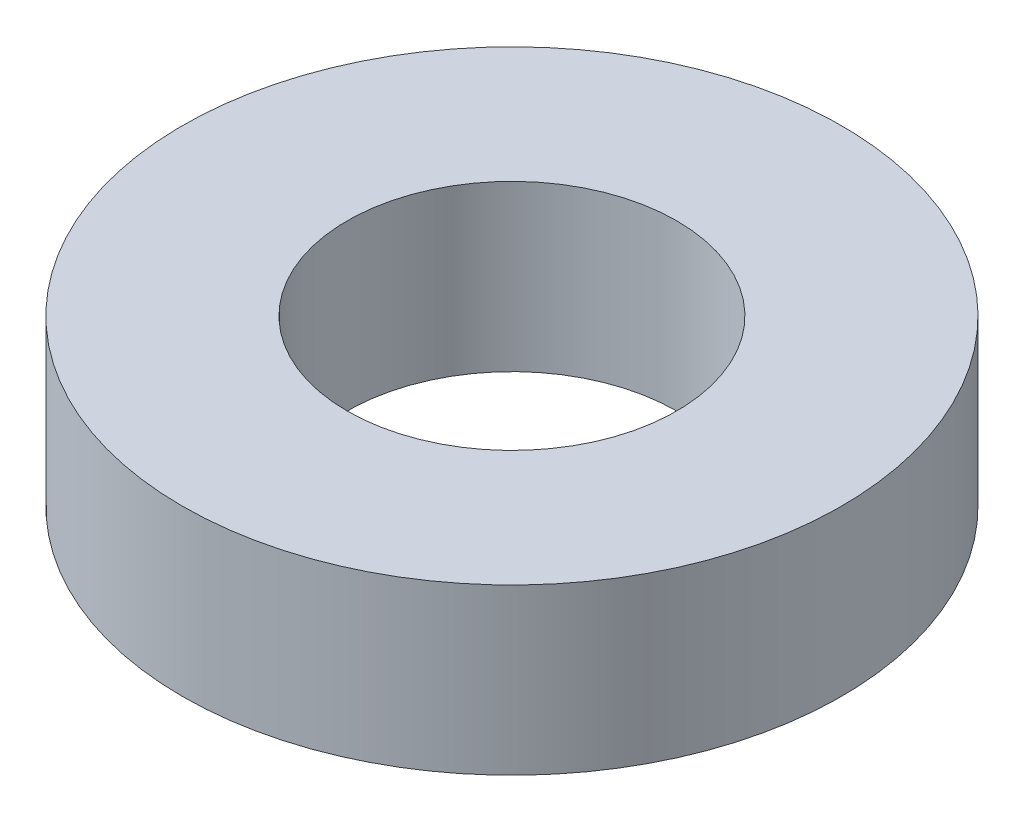
ISO-10303-21;
HEADER;
FILE_DESCRIPTION(('STEP AP214'),'2;1');
FILE_NAME('part.step','',(''),(''),'','','');
FILE_SCHEMA(('AUTOMOTIVE_DESIGN { 1 0 10303 214 1 1 1 1 }'));
ENDSEC;
DATA;
#1=APPLICATION_CONTEXT('core data for automotive mechanical design processes');
#2=APPLICATION_PROTOCOL_DEFINITION('international standard','automotive_design',2000,#1);
#3=PRODUCT_CONTEXT('',#1,'mechanical');
#4=PRODUCT('Part','Part','',(#3));
#5=PRODUCT_RELATED_PRODUCT_CATEGORY('part','',(#4));
#6=PRODUCT_DEFINITION_FORMATION('','',#4);
#7=PRODUCT_DEFINITION_CONTEXT('part definition',#1,'design');
#8=PRODUCT_DEFINITION('design','',#6,#7);
#9=PRODUCT_DEFINITION_SHAPE('','',#8);
#10=(LENGTH_UNIT() NAMED_UNIT(*) SI_UNIT(.MILLI.,.METRE.));
#11=(NAMED_UNIT(*) PLANE_ANGLE_UNIT() SI_UNIT($,.RADIAN.));
#12=(NAMED_UNIT(*) SI_UNIT($,.STERADIAN.) SOLID_ANGLE_UNIT());
#13=UNCERTAINTY_MEASURE_WITH_UNIT(LENGTH_MEASURE(1.E-05),#10,'distance_accuracy_value','');
#14=(GEOMETRIC_REPRESENTATION_CONTEXT(3) GLOBAL_UNCERTAINTY_ASSIGNED_CONTEXT((#13)) GLOBAL_UNIT_ASSIGNED_CONTEXT((#10,
#11,#12)) REPRESENTATION_CONTEXT('',''));
#15=CARTESIAN_POINT('',(0.,0.,0.));
#16=DIRECTION('',(0.,0.,1.));
#17=DIRECTION('',(1.,0.,0.));
#18=AXIS2_PLACEMENT_3D('',#15,#16,#17);
#19=CARTESIAN_POINT('',(0.,3.175,0.));
#20=DIRECTION('',(0.,1.,0.));
#21=DIRECTION('',(0.,0.,1.));
#22=AXIS2_PLACEMENT_3D('',#19,#20,#21);
#23=PLANE('',#22);
#24=CARTESIAN_POINT('',(0.,3.175,0.));
#25=DIRECTION('',(0.,1.,0.));
#26=DIRECTION('',(0.,0.,1.));
#27=AXIS2_PLACEMENT_3D('',#24,#25,#26);
#28=CIRCLE('',#27,6.35);
#29=CARTESIAN_POINT('',(0.,3.175,6.35));
#30=VERTEX_POINT('',#29);
#31=EDGE_CURVE('E10',#30,#30,#28,.T.);
#32=ORIENTED_EDGE('',*,*,#31,.T.);
#33=EDGE_LOOP('',(#32));
#34=FACE_BOUND('',#33,.T.);
#35=CARTESIAN_POINT('',(0.,3.175,0.));
#36=DIRECTION('',(0.,1.,0.));
#37=DIRECTION('',(0.,0.,1.));
#38=AXIS2_PLACEMENT_3D('',#35,#36,#37);
#39=CIRCLE('',#38,3.175);
#40=CARTESIAN_POINT('',(0.,3.175,3.175));
#41=VERTEX_POINT('',#40);
#42=EDGE_CURVE('E52',#41,#41,#39,.T.);
#43=ORIENTED_EDGE('',*,*,#42,.F.);
#44=EDGE_LOOP('',(#43));
#45=FACE_BOUND('',#44,.T.);
#46=ADVANCED_FACE('F41',(#34,#45),#23,.T.);
#47=CARTESIAN_POINT('',(0.,0.,0.));
#48=DIRECTION('',(0.,1.,0.));
#49=DIRECTION('',(0.,0.,1.));
#50=AXIS2_PLACEMENT_3D('',#47,#48,#49);
#51=PLANE('',#50);
#52=CARTESIAN_POINT('',(0.,0.,0.));
#53=DIRECTION('',(0.,1.,0.));
#54=DIRECTION('',(0.,0.,1.));
#55=AXIS2_PLACEMENT_3D('',#52,#53,#54);
#56=CIRCLE('',#55,6.35);
#57=CARTESIAN_POINT('',(0.,0.,6.35));
#58=VERTEX_POINT('',#57);
#59=EDGE_CURVE('E45',#58,#58,#56,.T.);
#60=ORIENTED_EDGE('',*,*,#59,.F.);
#61=EDGE_LOOP('',(#60));
#62=FACE_BOUND('',#61,.T.);
#63=CARTESIAN_POINT('',(0.,0.,0.));
#64=DIRECTION('',(0.,1.,0.));
#65=DIRECTION('',(0.,0.,1.));
#66=AXIS2_PLACEMENT_3D('',#63,#64,#65);
#67=CIRCLE('',#66,3.175);
#68=CARTESIAN_POINT('',(0.,0.,3.175));
#69=VERTEX_POINT('',#68);
#70=EDGE_CURVE('E54',#69,#69,#67,.T.);
#71=ORIENTED_EDGE('',*,*,#70,.T.);
#72=EDGE_LOOP('',(#71));
#73=FACE_BOUND('',#72,.T.);
#74=ADVANCED_FACE('F64',(#62,#73),#51,.F.);
#75=CARTESIAN_POINT('',(0.,3.175,0.));
#76=DIRECTION('',(0.,-1.,0.));
#77=DIRECTION('',(0.,0.,-1.));
#78=AXIS2_PLACEMENT_3D('',#75,#76,#77);
#79=CYLINDRICAL_SURFACE('',#78,6.35);
#80=ORIENTED_EDGE('',*,*,#31,.F.);
#81=EDGE_LOOP('',(#80));
#82=FACE_BOUND('',#81,.T.);
#83=ORIENTED_EDGE('',*,*,#59,.T.);
#84=EDGE_LOOP('',(#83));
#85=FACE_BOUND('',#84,.T.);
#86=ADVANCED_FACE('F43',(#82,#85),#79,.T.);
#87=CARTESIAN_POINT('',(0.,3.175,0.));
#88=DIRECTION('',(0.,-1.,0.));
#89=DIRECTION('',(0.,0.,-1.));
#90=AXIS2_PLACEMENT_3D('',#87,#88,#89);
#91=CYLINDRICAL_SURFACE('',#90,3.175);
#92=ORIENTED_EDGE('',*,*,#42,.T.);
#93=EDGE_LOOP('',(#92));
#94=FACE_BOUND('',#93,.T.);
#95=ORIENTED_EDGE('',*,*,#70,.F.);
#96=EDGE_LOOP('',(#95));
#97=FACE_BOUND('',#96,.T.);
#98=ADVANCED_FACE('F60',(#94,#97),#91,.F.);
#99=CLOSED_SHELL('',(#46,#74,#86,#98));
#100=MANIFOLD_SOLID_BREP('B2',#99);
#101=ADVANCED_BREP_SHAPE_REPRESENTATION('',(#18,#100),#14);
#102=SHAPE_DEFINITION_REPRESENTATION(#9,#101);
ENDSEC;
END-ISO-10303-21;
